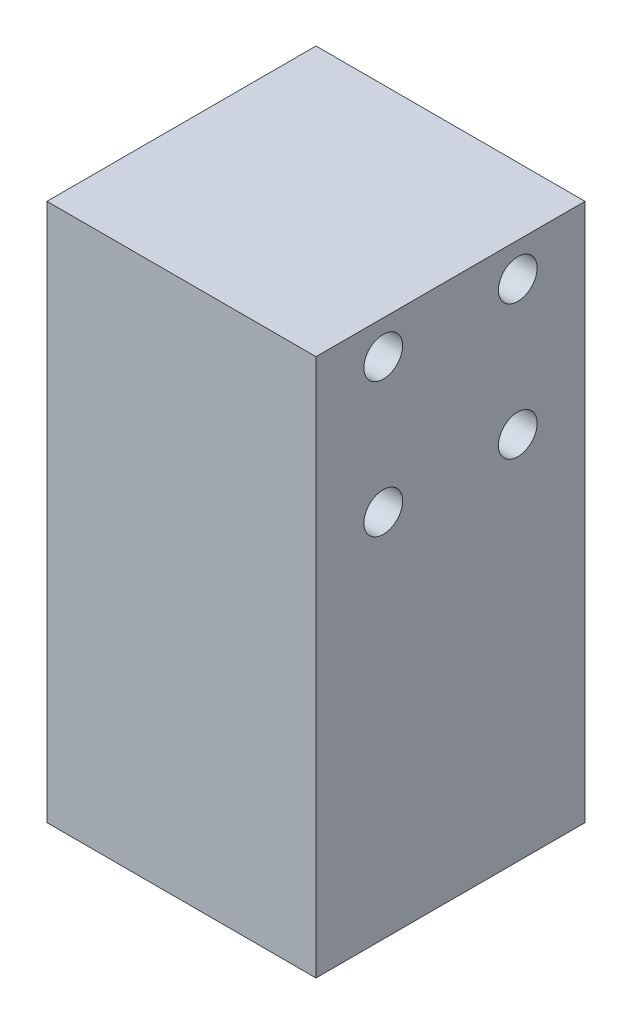
ISO-10303-21;
HEADER;
FILE_DESCRIPTION(('STEP AP214'),'2;1');
FILE_NAME('part.step','',(''),(''),'','','');
FILE_SCHEMA(('AUTOMOTIVE_DESIGN { 1 0 10303 214 1 1 1 1 }'));
ENDSEC;
DATA;
#1=APPLICATION_CONTEXT('core data for automotive mechanical design processes');
#2=APPLICATION_PROTOCOL_DEFINITION('international standard','automotive_design',2000,#1);
#3=PRODUCT_CONTEXT('',#1,'mechanical');
#4=PRODUCT('Part','Part','',(#3));
#5=PRODUCT_RELATED_PRODUCT_CATEGORY('part','',(#4));
#6=PRODUCT_DEFINITION_FORMATION('','',#4);
#7=PRODUCT_DEFINITION_CONTEXT('part definition',#1,'design');
#8=PRODUCT_DEFINITION('design','',#6,#7);
#9=PRODUCT_DEFINITION_SHAPE('','',#8);
#10=(LENGTH_UNIT() NAMED_UNIT(*) SI_UNIT(.MILLI.,.METRE.));
#11=(NAMED_UNIT(*) PLANE_ANGLE_UNIT() SI_UNIT($,.RADIAN.));
#12=(NAMED_UNIT(*) SI_UNIT($,.STERADIAN.) SOLID_ANGLE_UNIT());
#13=UNCERTAINTY_MEASURE_WITH_UNIT(LENGTH_MEASURE(1.E-05),#10,'distance_accuracy_value','');
#14=(GEOMETRIC_REPRESENTATION_CONTEXT(3) GLOBAL_UNCERTAINTY_ASSIGNED_CONTEXT((#13)) GLOBAL_UNIT_ASSIGNED_CONTEXT((#10,
#11,#12)) REPRESENTATION_CONTEXT('',''));
#15=CARTESIAN_POINT('',(0.,0.,0.));
#16=DIRECTION('',(0.,0.,1.));
#17=DIRECTION('',(1.,0.,0.));
#18=AXIS2_PLACEMENT_3D('',#15,#16,#17);
#19=CARTESIAN_POINT('',(12.7,50.8,12.7));
#20=DIRECTION('',(-1.,0.,0.));
#21=DIRECTION('',(0.,0.,1.));
#22=AXIS2_PLACEMENT_3D('',#19,#20,#21);
#23=PLANE('',#22);
#24=CARTESIAN_POINT('',(12.7,34.925,6.34999999999999));
#25=DIRECTION('',(1.,0.,0.));
#26=DIRECTION('',(0.,0.,-1.));
#27=AXIS2_PLACEMENT_3D('',#24,#25,#26);
#28=CIRCLE('',#27,1.8288);
#29=CARTESIAN_POINT('',(12.7,34.925,4.52119999999999));
#30=VERTEX_POINT('',#29);
#31=EDGE_CURVE('E128',#30,#30,#28,.T.);
#32=ORIENTED_EDGE('',*,*,#31,.F.);
#33=EDGE_LOOP('',(#32));
#34=FACE_BOUND('',#33,.T.);
#35=CARTESIAN_POINT('',(12.7,34.925,-6.35000000000001));
#36=DIRECTION('',(1.,0.,0.));
#37=DIRECTION('',(0.,0.,-1.));
#38=AXIS2_PLACEMENT_3D('',#35,#36,#37);
#39=CIRCLE('',#38,1.8288);
#40=CARTESIAN_POINT('',(12.7,34.925,-8.17880000000001));
#41=VERTEX_POINT('',#40);
#42=EDGE_CURVE('E122',#41,#41,#39,.T.);
#43=ORIENTED_EDGE('',*,*,#42,.F.);
#44=EDGE_LOOP('',(#43));
#45=FACE_BOUND('',#44,.T.);
#46=CARTESIAN_POINT('',(12.7,47.625,-6.35000000000001));
#47=DIRECTION('',(1.,0.,0.));
#48=DIRECTION('',(0.,0.,-1.));
#49=AXIS2_PLACEMENT_3D('',#46,#47,#48);
#50=CIRCLE('',#49,1.8288);
#51=CARTESIAN_POINT('',(12.7,47.625,-8.17880000000001));
#52=VERTEX_POINT('',#51);
#53=EDGE_CURVE('E116',#52,#52,#50,.T.);
#54=ORIENTED_EDGE('',*,*,#53,.F.);
#55=EDGE_LOOP('',(#54));
#56=FACE_BOUND('',#55,.T.);
#57=CARTESIAN_POINT('',(12.7,47.625,6.34999999999999));
#58=DIRECTION('',(1.,0.,0.));
#59=DIRECTION('',(0.,0.,-1.));
#60=AXIS2_PLACEMENT_3D('',#57,#58,#59);
#61=CIRCLE('',#60,1.8288);
#62=CARTESIAN_POINT('',(12.7,47.625,4.52119999999999));
#63=VERTEX_POINT('',#62);
#64=EDGE_CURVE('E110',#63,#63,#61,.T.);
#65=ORIENTED_EDGE('',*,*,#64,.F.);
#66=EDGE_LOOP('',(#65));
#67=FACE_BOUND('',#66,.T.);
#68=DIRECTION('',(0.,0.,-1.));
#69=VECTOR('',#68,1.);
#70=CARTESIAN_POINT('',(12.7,0.,12.7));
#71=LINE('',#70,#69);
#72=CARTESIAN_POINT('',(12.7,0.,12.7));
#73=VERTEX_POINT('',#72);
#74=CARTESIAN_POINT('',(12.7,0.,-12.7));
#75=VERTEX_POINT('',#74);
#76=EDGE_CURVE('E96',#73,#75,#71,.T.);
#77=ORIENTED_EDGE('',*,*,#76,.T.);
#78=DIRECTION('',(0.,-1.,0.));
#79=VECTOR('',#78,1.);
#80=CARTESIAN_POINT('',(12.7,50.8,-12.7));
#81=LINE('',#80,#79);
#82=CARTESIAN_POINT('',(12.7,50.8,-12.7));
#83=VERTEX_POINT('',#82);
#84=EDGE_CURVE('E11',#83,#75,#81,.T.);
#85=ORIENTED_EDGE('',*,*,#84,.F.);
#86=DIRECTION('',(0.,0.,-1.));
#87=VECTOR('',#86,1.);
#88=CARTESIAN_POINT('',(12.7,50.8,12.7));
#89=LINE('',#88,#87);
#90=CARTESIAN_POINT('',(12.7,50.8,12.7));
#91=VERTEX_POINT('',#90);
#92=EDGE_CURVE('E84',#91,#83,#89,.T.);
#93=ORIENTED_EDGE('',*,*,#92,.F.);
#94=DIRECTION('',(0.,-1.,0.));
#95=VECTOR('',#94,1.);
#96=CARTESIAN_POINT('',(12.7,50.8,12.7));
#97=LINE('',#96,#95);
#98=EDGE_CURVE('E92',#91,#73,#97,.T.);
#99=ORIENTED_EDGE('',*,*,#98,.T.);
#100=EDGE_LOOP('',(#77,#85,#93,#99));
#101=FACE_BOUND('',#100,.T.);
#102=ADVANCED_FACE('F33',(#34,#45,#56,#67,#101),#23,.F.);
#103=CARTESIAN_POINT('',(-12.7,50.8,-12.7));
#104=DIRECTION('',(0.,0.,1.));
#105=DIRECTION('',(1.,0.,0.));
#106=AXIS2_PLACEMENT_3D('',#103,#104,#105);
#107=PLANE('',#106);
#108=DIRECTION('',(-1.,0.,0.));
#109=VECTOR('',#108,1.);
#110=CARTESIAN_POINT('',(-12.7,0.,-12.7));
#111=LINE('',#110,#109);
#112=CARTESIAN_POINT('',(-12.7,0.,-12.7));
#113=VERTEX_POINT('',#112);
#114=EDGE_CURVE('E88',#75,#113,#111,.T.);
#115=ORIENTED_EDGE('',*,*,#114,.T.);
#116=DIRECTION('',(0.,-1.,0.));
#117=VECTOR('',#116,1.);
#118=CARTESIAN_POINT('',(-12.7,50.8,-12.7));
#119=LINE('',#118,#117);
#120=CARTESIAN_POINT('',(-12.7,50.8,-12.7));
#121=VERTEX_POINT('',#120);
#122=EDGE_CURVE('E41',#121,#113,#119,.T.);
#123=ORIENTED_EDGE('',*,*,#122,.F.);
#124=DIRECTION('',(-1.,0.,0.));
#125=VECTOR('',#124,1.);
#126=CARTESIAN_POINT('',(-12.7,50.8,-12.7));
#127=LINE('',#126,#125);
#128=EDGE_CURVE('E79',#83,#121,#127,.T.);
#129=ORIENTED_EDGE('',*,*,#128,.F.);
#130=ORIENTED_EDGE('',*,*,#84,.T.);
#131=EDGE_LOOP('',(#115,#123,#129,#130));
#132=FACE_BOUND('',#131,.T.);
#133=ADVANCED_FACE('F87',(#132),#107,.F.);
#134=CARTESIAN_POINT('',(-12.7,50.8,12.7));
#135=DIRECTION('',(1.,0.,0.));
#136=DIRECTION('',(0.,0.,-1.));
#137=AXIS2_PLACEMENT_3D('',#134,#135,#136);
#138=PLANE('',#137);
#139=DIRECTION('',(0.,0.,1.));
#140=VECTOR('',#139,1.);
#141=CARTESIAN_POINT('',(-12.7,0.,12.7));
#142=LINE('',#141,#140);
#143=CARTESIAN_POINT('',(-12.7,0.,12.7));
#144=VERTEX_POINT('',#143);
#145=EDGE_CURVE('E66',#113,#144,#142,.T.);
#146=ORIENTED_EDGE('',*,*,#145,.T.);
#147=DIRECTION('',(0.,-1.,0.));
#148=VECTOR('',#147,1.);
#149=CARTESIAN_POINT('',(-12.7,50.8,12.7));
#150=LINE('',#149,#148);
#151=CARTESIAN_POINT('',(-12.7,50.8,12.7));
#152=VERTEX_POINT('',#151);
#153=EDGE_CURVE('E89',#152,#144,#150,.T.);
#154=ORIENTED_EDGE('',*,*,#153,.F.);
#155=DIRECTION('',(0.,0.,1.));
#156=VECTOR('',#155,1.);
#157=CARTESIAN_POINT('',(-12.7,50.8,12.7));
#158=LINE('',#157,#156);
#159=EDGE_CURVE('E82',#121,#152,#158,.T.);
#160=ORIENTED_EDGE('',*,*,#159,.F.);
#161=ORIENTED_EDGE('',*,*,#122,.T.);
#162=EDGE_LOOP('',(#146,#154,#160,#161));
#163=FACE_BOUND('',#162,.T.);
#164=ADVANCED_FACE('F90',(#163),#138,.F.);
#165=CARTESIAN_POINT('',(-12.7,50.8,12.7));
#166=DIRECTION('',(0.,0.,-1.));
#167=DIRECTION('',(-1.,0.,0.));
#168=AXIS2_PLACEMENT_3D('',#165,#166,#167);
#169=PLANE('',#168);
#170=DIRECTION('',(1.,0.,0.));
#171=VECTOR('',#170,1.);
#172=CARTESIAN_POINT('',(-12.7,0.,12.7));
#173=LINE('',#172,#171);
#174=EDGE_CURVE('E72',#144,#73,#173,.T.);
#175=ORIENTED_EDGE('',*,*,#174,.T.);
#176=ORIENTED_EDGE('',*,*,#98,.F.);
#177=DIRECTION('',(1.,0.,0.));
#178=VECTOR('',#177,1.);
#179=CARTESIAN_POINT('',(-12.7,50.8,12.7));
#180=LINE('',#179,#178);
#181=EDGE_CURVE('E49',#152,#91,#180,.T.);
#182=ORIENTED_EDGE('',*,*,#181,.F.);
#183=ORIENTED_EDGE('',*,*,#153,.T.);
#184=EDGE_LOOP('',(#175,#176,#182,#183));
#185=FACE_BOUND('',#184,.T.);
#186=ADVANCED_FACE('F104',(#185),#169,.F.);
#187=CARTESIAN_POINT('',(0.,50.8,0.));
#188=DIRECTION('',(0.,-1.,0.));
#189=DIRECTION('',(0.,0.,-1.));
#190=AXIS2_PLACEMENT_3D('',#187,#188,#189);
#191=PLANE('',#190);
#192=ORIENTED_EDGE('',*,*,#92,.T.);
#193=ORIENTED_EDGE('',*,*,#128,.T.);
#194=ORIENTED_EDGE('',*,*,#159,.T.);
#195=ORIENTED_EDGE('',*,*,#181,.T.);
#196=EDGE_LOOP('',(#192,#193,#194,#195));
#197=FACE_BOUND('',#196,.T.);
#198=ADVANCED_FACE('F80',(#197),#191,.F.);
#199=CARTESIAN_POINT('',(0.,0.,0.));
#200=DIRECTION('',(0.,-1.,0.));
#201=DIRECTION('',(0.,0.,-1.));
#202=AXIS2_PLACEMENT_3D('',#199,#200,#201);
#203=PLANE('',#202);
#204=CARTESIAN_POINT('',(-6.35,0.,-6.35));
#205=DIRECTION('',(0.,-1.,0.));
#206=DIRECTION('',(0.,0.,-1.));
#207=AXIS2_PLACEMENT_3D('',#204,#205,#206);
#208=CIRCLE('',#207,1.8288);
#209=CARTESIAN_POINT('',(-6.35,0.,-8.1788));
#210=VERTEX_POINT('',#209);
#211=EDGE_CURVE('E152',#210,#210,#208,.T.);
#212=ORIENTED_EDGE('',*,*,#211,.F.);
#213=EDGE_LOOP('',(#212));
#214=FACE_BOUND('',#213,.T.);
#215=CARTESIAN_POINT('',(6.35,0.,-6.35));
#216=DIRECTION('',(0.,-1.,0.));
#217=DIRECTION('',(0.,0.,-1.));
#218=AXIS2_PLACEMENT_3D('',#215,#216,#217);
#219=CIRCLE('',#218,1.8288);
#220=CARTESIAN_POINT('',(6.35,0.,-8.1788));
#221=VERTEX_POINT('',#220);
#222=EDGE_CURVE('E146',#221,#221,#219,.T.);
#223=ORIENTED_EDGE('',*,*,#222,.F.);
#224=EDGE_LOOP('',(#223));
#225=FACE_BOUND('',#224,.T.);
#226=CARTESIAN_POINT('',(6.35,0.,6.35));
#227=DIRECTION('',(0.,-1.,0.));
#228=DIRECTION('',(0.,0.,-1.));
#229=AXIS2_PLACEMENT_3D('',#226,#227,#228);
#230=CIRCLE('',#229,1.8288);
#231=CARTESIAN_POINT('',(6.35,0.,4.5212));
#232=VERTEX_POINT('',#231);
#233=EDGE_CURVE('E140',#232,#232,#230,.T.);
#234=ORIENTED_EDGE('',*,*,#233,.F.);
#235=EDGE_LOOP('',(#234));
#236=FACE_BOUND('',#235,.T.);
#237=CARTESIAN_POINT('',(-6.35,0.,6.35));
#238=DIRECTION('',(0.,-1.,0.));
#239=DIRECTION('',(0.,0.,-1.));
#240=AXIS2_PLACEMENT_3D('',#237,#238,#239);
#241=CIRCLE('',#240,1.8288);
#242=CARTESIAN_POINT('',(-6.35,0.,4.5212));
#243=VERTEX_POINT('',#242);
#244=EDGE_CURVE('E134',#243,#243,#241,.T.);
#245=ORIENTED_EDGE('',*,*,#244,.F.);
#246=EDGE_LOOP('',(#245));
#247=FACE_BOUND('',#246,.T.);
#248=ORIENTED_EDGE('',*,*,#76,.F.);
#249=ORIENTED_EDGE('',*,*,#174,.F.);
#250=ORIENTED_EDGE('',*,*,#145,.F.);
#251=ORIENTED_EDGE('',*,*,#114,.F.);
#252=EDGE_LOOP('',(#248,#249,#250,#251));
#253=FACE_BOUND('',#252,.T.);
#254=ADVANCED_FACE('F107',(#214,#225,#236,#247,#253),#203,.T.);
#255=CARTESIAN_POINT('',(0.,47.625,6.34999999999999));
#256=DIRECTION('',(1.,0.,0.));
#257=DIRECTION('',(0.,0.,-1.));
#258=AXIS2_PLACEMENT_3D('',#255,#256,#257);
#259=CYLINDRICAL_SURFACE('',#258,1.8288);
#260=CARTESIAN_POINT('',(0.,47.625,6.34999999999999));
#261=DIRECTION('',(1.,0.,0.));
#262=DIRECTION('',(0.,0.,-1.));
#263=AXIS2_PLACEMENT_3D('',#260,#261,#262);
#264=CIRCLE('',#263,1.8288);
#265=CARTESIAN_POINT('',(0.,47.625,4.52119999999999));
#266=VERTEX_POINT('',#265);
#267=EDGE_CURVE('E99',#266,#266,#264,.T.);
#268=ORIENTED_EDGE('',*,*,#267,.F.);
#269=EDGE_LOOP('',(#268));
#270=FACE_BOUND('',#269,.T.);
#271=ORIENTED_EDGE('',*,*,#64,.T.);
#272=EDGE_LOOP('',(#271));
#273=FACE_BOUND('',#272,.T.);
#274=ADVANCED_FACE('F169',(#270,#273),#259,.F.);
#275=CARTESIAN_POINT('',(0.,47.625,6.34999999999999));
#276=DIRECTION('',(1.,0.,0.));
#277=DIRECTION('',(0.,0.,-1.));
#278=AXIS2_PLACEMENT_3D('',#275,#276,#277);
#279=PLANE('',#278);
#280=ORIENTED_EDGE('',*,*,#267,.T.);
#281=EDGE_LOOP('',(#280));
#282=FACE_BOUND('',#281,.T.);
#283=ADVANCED_FACE('F208',(#282),#279,.T.);
#284=CARTESIAN_POINT('',(0.,47.625,-6.35000000000001));
#285=DIRECTION('',(1.,0.,0.));
#286=DIRECTION('',(0.,0.,-1.));
#287=AXIS2_PLACEMENT_3D('',#284,#285,#286);
#288=CYLINDRICAL_SURFACE('',#287,1.8288);
#289=CARTESIAN_POINT('',(0.,47.625,-6.35000000000001));
#290=DIRECTION('',(1.,0.,0.));
#291=DIRECTION('',(0.,0.,-1.));
#292=AXIS2_PLACEMENT_3D('',#289,#290,#291);
#293=CIRCLE('',#292,1.8288);
#294=CARTESIAN_POINT('',(0.,47.625,-8.17880000000001));
#295=VERTEX_POINT('',#294);
#296=EDGE_CURVE('E113',#295,#295,#293,.T.);
#297=ORIENTED_EDGE('',*,*,#296,.F.);
#298=EDGE_LOOP('',(#297));
#299=FACE_BOUND('',#298,.T.);
#300=ORIENTED_EDGE('',*,*,#53,.T.);
#301=EDGE_LOOP('',(#300));
#302=FACE_BOUND('',#301,.T.);
#303=ADVANCED_FACE('F214',(#299,#302),#288,.F.);
#304=CARTESIAN_POINT('',(0.,47.625,-6.35000000000001));
#305=DIRECTION('',(1.,0.,0.));
#306=DIRECTION('',(0.,0.,-1.));
#307=AXIS2_PLACEMENT_3D('',#304,#305,#306);
#308=PLANE('',#307);
#309=ORIENTED_EDGE('',*,*,#296,.T.);
#310=EDGE_LOOP('',(#309));
#311=FACE_BOUND('',#310,.T.);
#312=ADVANCED_FACE('F341',(#311),#308,.T.);
#313=CARTESIAN_POINT('',(0.,34.925,-6.35000000000001));
#314=DIRECTION('',(1.,0.,0.));
#315=DIRECTION('',(0.,0.,-1.));
#316=AXIS2_PLACEMENT_3D('',#313,#314,#315);
#317=CYLINDRICAL_SURFACE('',#316,1.8288);
#318=CARTESIAN_POINT('',(0.,34.925,-6.35000000000001));
#319=DIRECTION('',(1.,0.,0.));
#320=DIRECTION('',(0.,0.,-1.));
#321=AXIS2_PLACEMENT_3D('',#318,#319,#320);
#322=CIRCLE('',#321,1.8288);
#323=CARTESIAN_POINT('',(0.,34.925,-8.17880000000001));
#324=VERTEX_POINT('',#323);
#325=EDGE_CURVE('E119',#324,#324,#322,.T.);
#326=ORIENTED_EDGE('',*,*,#325,.F.);
#327=EDGE_LOOP('',(#326));
#328=FACE_BOUND('',#327,.T.);
#329=ORIENTED_EDGE('',*,*,#42,.T.);
#330=EDGE_LOOP('',(#329));
#331=FACE_BOUND('',#330,.T.);
#332=ADVANCED_FACE('F332',(#328,#331),#317,.F.);
#333=CARTESIAN_POINT('',(0.,34.925,-6.35000000000001));
#334=DIRECTION('',(1.,0.,0.));
#335=DIRECTION('',(0.,0.,-1.));
#336=AXIS2_PLACEMENT_3D('',#333,#334,#335);
#337=PLANE('',#336);
#338=ORIENTED_EDGE('',*,*,#325,.T.);
#339=EDGE_LOOP('',(#338));
#340=FACE_BOUND('',#339,.T.);
#341=ADVANCED_FACE('F323',(#340),#337,.T.);
#342=CARTESIAN_POINT('',(0.,34.925,6.34999999999999));
#343=DIRECTION('',(1.,0.,0.));
#344=DIRECTION('',(0.,0.,-1.));
#345=AXIS2_PLACEMENT_3D('',#342,#343,#344);
#346=CYLINDRICAL_SURFACE('',#345,1.8288);
#347=CARTESIAN_POINT('',(0.,34.925,6.34999999999999));
#348=DIRECTION('',(1.,0.,0.));
#349=DIRECTION('',(0.,0.,-1.));
#350=AXIS2_PLACEMENT_3D('',#347,#348,#349);
#351=CIRCLE('',#350,1.8288);
#352=CARTESIAN_POINT('',(0.,34.925,4.52119999999999));
#353=VERTEX_POINT('',#352);
#354=EDGE_CURVE('E125',#353,#353,#351,.T.);
#355=ORIENTED_EDGE('',*,*,#354,.F.);
#356=EDGE_LOOP('',(#355));
#357=FACE_BOUND('',#356,.T.);
#358=ORIENTED_EDGE('',*,*,#31,.T.);
#359=EDGE_LOOP('',(#358));
#360=FACE_BOUND('',#359,.T.);
#361=ADVANCED_FACE('F190',(#357,#360),#346,.F.);
#362=CARTESIAN_POINT('',(0.,34.925,6.34999999999999));
#363=DIRECTION('',(1.,0.,0.));
#364=DIRECTION('',(0.,0.,-1.));
#365=AXIS2_PLACEMENT_3D('',#362,#363,#364);
#366=PLANE('',#365);
#367=ORIENTED_EDGE('',*,*,#354,.T.);
#368=EDGE_LOOP('',(#367));
#369=FACE_BOUND('',#368,.T.);
#370=ADVANCED_FACE('F180',(#369),#366,.T.);
#371=CARTESIAN_POINT('',(-6.35,12.7,6.35));
#372=DIRECTION('',(0.,-1.,0.));
#373=DIRECTION('',(0.,0.,-1.));
#374=AXIS2_PLACEMENT_3D('',#371,#372,#373);
#375=CYLINDRICAL_SURFACE('',#374,1.8288);
#376=CARTESIAN_POINT('',(-6.35,12.7,6.35));
#377=DIRECTION('',(0.,-1.,0.));
#378=DIRECTION('',(0.,0.,-1.));
#379=AXIS2_PLACEMENT_3D('',#376,#377,#378);
#380=CIRCLE('',#379,1.8288);
#381=CARTESIAN_POINT('',(-6.35,12.7,4.5212));
#382=VERTEX_POINT('',#381);
#383=EDGE_CURVE('E131',#382,#382,#380,.T.);
#384=ORIENTED_EDGE('',*,*,#383,.F.);
#385=EDGE_LOOP('',(#384));
#386=FACE_BOUND('',#385,.T.);
#387=ORIENTED_EDGE('',*,*,#244,.T.);
#388=EDGE_LOOP('',(#387));
#389=FACE_BOUND('',#388,.T.);
#390=ADVANCED_FACE('F177',(#386,#389),#375,.F.);
#391=CARTESIAN_POINT('',(-6.35,12.7,6.35));
#392=DIRECTION('',(0.,-1.,0.));
#393=DIRECTION('',(0.,0.,-1.));
#394=AXIS2_PLACEMENT_3D('',#391,#392,#393);
#395=PLANE('',#394);
#396=ORIENTED_EDGE('',*,*,#383,.T.);
#397=EDGE_LOOP('',(#396));
#398=FACE_BOUND('',#397,.T.);
#399=ADVANCED_FACE('F179',(#398),#395,.T.);
#400=CARTESIAN_POINT('',(6.35,12.7,6.35));
#401=DIRECTION('',(0.,-1.,0.));
#402=DIRECTION('',(0.,0.,-1.));
#403=AXIS2_PLACEMENT_3D('',#400,#401,#402);
#404=CYLINDRICAL_SURFACE('',#403,1.8288);
#405=CARTESIAN_POINT('',(6.35,12.7,6.35));
#406=DIRECTION('',(0.,-1.,0.));
#407=DIRECTION('',(0.,0.,-1.));
#408=AXIS2_PLACEMENT_3D('',#405,#406,#407);
#409=CIRCLE('',#408,1.8288);
#410=CARTESIAN_POINT('',(6.35,12.7,4.5212));
#411=VERTEX_POINT('',#410);
#412=EDGE_CURVE('E137',#411,#411,#409,.T.);
#413=ORIENTED_EDGE('',*,*,#412,.F.);
#414=EDGE_LOOP('',(#413));
#415=FACE_BOUND('',#414,.T.);
#416=ORIENTED_EDGE('',*,*,#233,.T.);
#417=EDGE_LOOP('',(#416));
#418=FACE_BOUND('',#417,.T.);
#419=ADVANCED_FACE('F187',(#415,#418),#404,.F.);
#420=CARTESIAN_POINT('',(6.35,12.7,6.35));
#421=DIRECTION('',(0.,-1.,0.));
#422=DIRECTION('',(0.,0.,-1.));
#423=AXIS2_PLACEMENT_3D('',#420,#421,#422);
#424=PLANE('',#423);
#425=ORIENTED_EDGE('',*,*,#412,.T.);
#426=EDGE_LOOP('',(#425));
#427=FACE_BOUND('',#426,.T.);
#428=ADVANCED_FACE('F265',(#427),#424,.T.);
#429=CARTESIAN_POINT('',(6.35,12.7,-6.35));
#430=DIRECTION('',(0.,-1.,0.));
#431=DIRECTION('',(0.,0.,-1.));
#432=AXIS2_PLACEMENT_3D('',#429,#430,#431);
#433=CYLINDRICAL_SURFACE('',#432,1.8288);
#434=CARTESIAN_POINT('',(6.35,12.7,-6.35));
#435=DIRECTION('',(0.,-1.,0.));
#436=DIRECTION('',(0.,0.,-1.));
#437=AXIS2_PLACEMENT_3D('',#434,#435,#436);
#438=CIRCLE('',#437,1.8288);
#439=CARTESIAN_POINT('',(6.35,12.7,-8.1788));
#440=VERTEX_POINT('',#439);
#441=EDGE_CURVE('E143',#440,#440,#438,.T.);
#442=ORIENTED_EDGE('',*,*,#441,.F.);
#443=EDGE_LOOP('',(#442));
#444=FACE_BOUND('',#443,.T.);
#445=ORIENTED_EDGE('',*,*,#222,.T.);
#446=EDGE_LOOP('',(#445));
#447=FACE_BOUND('',#446,.T.);
#448=ADVANCED_FACE('F275',(#444,#447),#433,.F.);
#449=CARTESIAN_POINT('',(6.35,12.7,-6.35));
#450=DIRECTION('',(0.,-1.,0.));
#451=DIRECTION('',(0.,0.,-1.));
#452=AXIS2_PLACEMENT_3D('',#449,#450,#451);
#453=PLANE('',#452);
#454=ORIENTED_EDGE('',*,*,#441,.T.);
#455=EDGE_LOOP('',(#454));
#456=FACE_BOUND('',#455,.T.);
#457=ADVANCED_FACE('F163',(#456),#453,.T.);
#458=CARTESIAN_POINT('',(-6.35,12.7,-6.35));
#459=DIRECTION('',(0.,-1.,0.));
#460=DIRECTION('',(0.,0.,-1.));
#461=AXIS2_PLACEMENT_3D('',#458,#459,#460);
#462=CYLINDRICAL_SURFACE('',#461,1.8288);
#463=CARTESIAN_POINT('',(-6.35,12.7,-6.35));
#464=DIRECTION('',(0.,-1.,0.));
#465=DIRECTION('',(0.,0.,-1.));
#466=AXIS2_PLACEMENT_3D('',#463,#464,#465);
#467=CIRCLE('',#466,1.8288);
#468=CARTESIAN_POINT('',(-6.35,12.7,-8.1788));
#469=VERTEX_POINT('',#468);
#470=EDGE_CURVE('E149',#469,#469,#467,.T.);
#471=ORIENTED_EDGE('',*,*,#470,.F.);
#472=EDGE_LOOP('',(#471));
#473=FACE_BOUND('',#472,.T.);
#474=ORIENTED_EDGE('',*,*,#211,.T.);
#475=EDGE_LOOP('',(#474));
#476=FACE_BOUND('',#475,.T.);
#477=ADVANCED_FACE('F160',(#473,#476),#462,.F.);
#478=CARTESIAN_POINT('',(-6.35,12.7,-6.35));
#479=DIRECTION('',(0.,-1.,0.));
#480=DIRECTION('',(0.,0.,-1.));
#481=AXIS2_PLACEMENT_3D('',#478,#479,#480);
#482=PLANE('',#481);
#483=ORIENTED_EDGE('',*,*,#470,.T.);
#484=EDGE_LOOP('',(#483));
#485=FACE_BOUND('',#484,.T.);
#486=ADVANCED_FACE('F158',(#485),#482,.T.);
#487=CLOSED_SHELL('',(#102,#133,#164,#186,#198,#254,#274,#283,#303,#312,#332,#341,#361,#370,
#390,#399,#419,#428,#448,#457,#477,#486));
#488=MANIFOLD_SOLID_BREP('B2',#487);
#489=ADVANCED_BREP_SHAPE_REPRESENTATION('',(#18,#488),#14);
#490=SHAPE_DEFINITION_REPRESENTATION(#9,#489);
ENDSEC;
END-ISO-10303-21;
